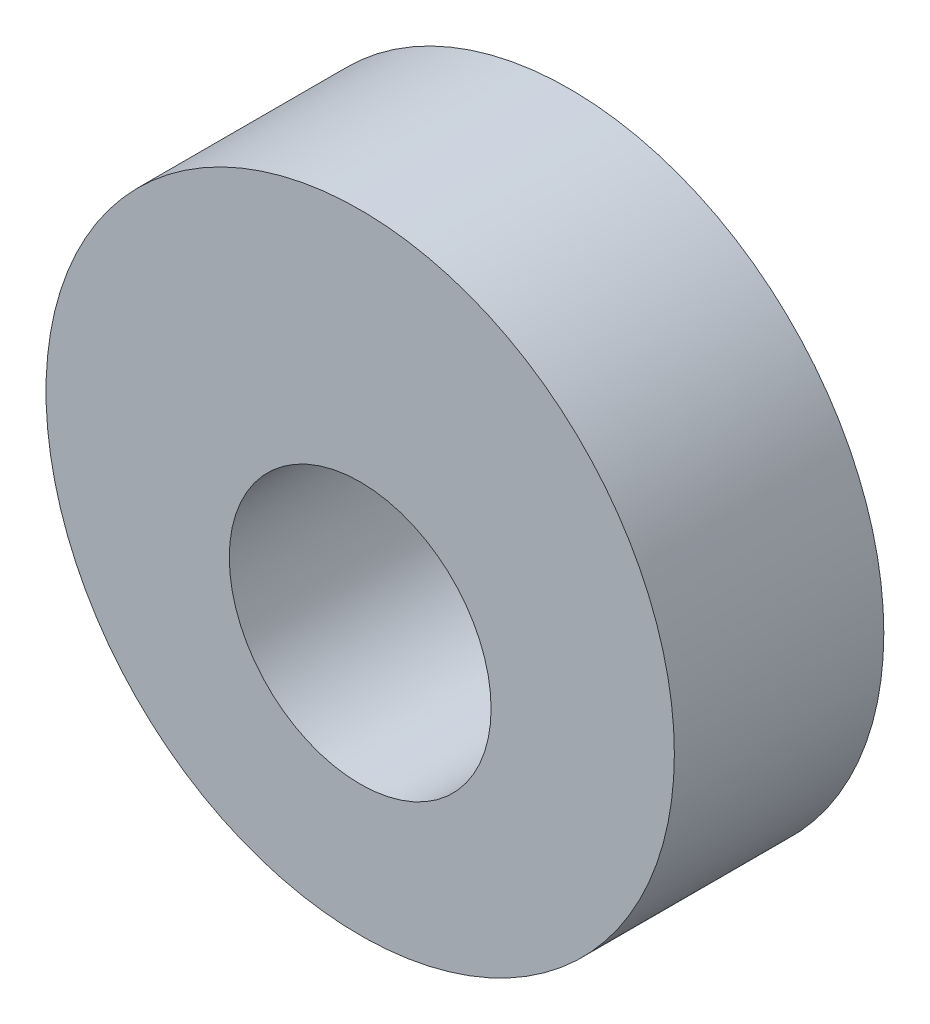
ISO-10303-21;
HEADER;
FILE_DESCRIPTION(('STEP AP214'),'2;1');
FILE_NAME('part.step','',(''),(''),'','','');
FILE_SCHEMA(('AUTOMOTIVE_DESIGN { 1 0 10303 214 1 1 1 1 }'));
ENDSEC;
DATA;
#1=APPLICATION_CONTEXT('core data for automotive mechanical design processes');
#2=APPLICATION_PROTOCOL_DEFINITION('international standard','automotive_design',2000,#1);
#3=PRODUCT_CONTEXT('',#1,'mechanical');
#4=PRODUCT('Part','Part','',(#3));
#5=PRODUCT_RELATED_PRODUCT_CATEGORY('part','',(#4));
#6=PRODUCT_DEFINITION_FORMATION('','',#4);
#7=PRODUCT_DEFINITION_CONTEXT('part definition',#1,'design');
#8=PRODUCT_DEFINITION('design','',#6,#7);
#9=PRODUCT_DEFINITION_SHAPE('','',#8);
#10=(LENGTH_UNIT() NAMED_UNIT(*) SI_UNIT(.MILLI.,.METRE.));
#11=(NAMED_UNIT(*) PLANE_ANGLE_UNIT() SI_UNIT($,.RADIAN.));
#12=(NAMED_UNIT(*) SI_UNIT($,.STERADIAN.) SOLID_ANGLE_UNIT());
#13=UNCERTAINTY_MEASURE_WITH_UNIT(LENGTH_MEASURE(1.E-05),#10,'distance_accuracy_value','');
#14=(GEOMETRIC_REPRESENTATION_CONTEXT(3) GLOBAL_UNCERTAINTY_ASSIGNED_CONTEXT((#13)) GLOBAL_UNIT_ASSIGNED_CONTEXT((#10,
#11,#12)) REPRESENTATION_CONTEXT('',''));
#15=CARTESIAN_POINT('',(0.,0.,0.));
#16=DIRECTION('',(0.,0.,1.));
#17=DIRECTION('',(1.,0.,0.));
#18=AXIS2_PLACEMENT_3D('',#15,#16,#17);
#19=CARTESIAN_POINT('',(0.,-1.5875,3.175));
#20=DIRECTION('',(0.,0.,1.));
#21=DIRECTION('',(1.,0.,0.));
#22=AXIS2_PLACEMENT_3D('',#19,#20,#21);
#23=CYLINDRICAL_SURFACE('',#22,3.96875);
#24=CARTESIAN_POINT('',(0.,-1.5875,3.175));
#25=DIRECTION('',(0.,0.,1.));
#26=DIRECTION('',(1.,0.,0.));
#27=AXIS2_PLACEMENT_3D('',#24,#25,#26);
#28=CIRCLE('',#27,3.96875);
#29=CARTESIAN_POINT('',(3.96875,-1.5875,3.175));
#30=VERTEX_POINT('',#29);
#31=EDGE_CURVE('E40',#30,#30,#28,.T.);
#32=ORIENTED_EDGE('',*,*,#31,.T.);
#33=EDGE_LOOP('',(#32));
#34=FACE_BOUND('',#33,.T.);
#35=CARTESIAN_POINT('',(0.,-1.5875,-3.175));
#36=DIRECTION('',(0.,0.,1.));
#37=DIRECTION('',(1.,0.,0.));
#38=AXIS2_PLACEMENT_3D('',#35,#36,#37);
#39=CIRCLE('',#38,3.96875);
#40=CARTESIAN_POINT('',(3.96875,-1.5875,-3.175));
#41=VERTEX_POINT('',#40);
#42=EDGE_CURVE('E46',#41,#41,#39,.T.);
#43=ORIENTED_EDGE('',*,*,#42,.F.);
#44=EDGE_LOOP('',(#43));
#45=FACE_BOUND('',#44,.T.);
#46=ADVANCED_FACE('F32',(#34,#45),#23,.F.);
#47=CARTESIAN_POINT('',(0.,0.,3.175));
#48=DIRECTION('',(0.,0.,1.));
#49=DIRECTION('',(1.,0.,0.));
#50=AXIS2_PLACEMENT_3D('',#47,#48,#49);
#51=CYLINDRICAL_SURFACE('',#50,9.525);
#52=CARTESIAN_POINT('',(0.,0.,3.175));
#53=DIRECTION('',(0.,0.,1.));
#54=DIRECTION('',(1.,0.,0.));
#55=AXIS2_PLACEMENT_3D('',#52,#53,#54);
#56=CIRCLE('',#55,9.525);
#57=CARTESIAN_POINT('',(9.525,0.,3.175));
#58=VERTEX_POINT('',#57);
#59=EDGE_CURVE('E10',#58,#58,#56,.T.);
#60=ORIENTED_EDGE('',*,*,#59,.F.);
#61=EDGE_LOOP('',(#60));
#62=FACE_BOUND('',#61,.T.);
#63=CARTESIAN_POINT('',(0.,0.,-3.175));
#64=DIRECTION('',(0.,0.,1.));
#65=DIRECTION('',(1.,0.,0.));
#66=AXIS2_PLACEMENT_3D('',#63,#64,#65);
#67=CIRCLE('',#66,9.525);
#68=CARTESIAN_POINT('',(9.525,0.,-3.175));
#69=VERTEX_POINT('',#68);
#70=EDGE_CURVE('E36',#69,#69,#67,.T.);
#71=ORIENTED_EDGE('',*,*,#70,.T.);
#72=EDGE_LOOP('',(#71));
#73=FACE_BOUND('',#72,.T.);
#74=ADVANCED_FACE('F34',(#62,#73),#51,.T.);
#75=CARTESIAN_POINT('',(0.,0.,3.175));
#76=DIRECTION('',(0.,0.,1.));
#77=DIRECTION('',(1.,0.,0.));
#78=AXIS2_PLACEMENT_3D('',#75,#76,#77);
#79=PLANE('',#78);
#80=ORIENTED_EDGE('',*,*,#31,.F.);
#81=EDGE_LOOP('',(#80));
#82=FACE_BOUND('',#81,.T.);
#83=ORIENTED_EDGE('',*,*,#59,.T.);
#84=EDGE_LOOP('',(#83));
#85=FACE_BOUND('',#84,.T.);
#86=ADVANCED_FACE('F56',(#82,#85),#79,.T.);
#87=CARTESIAN_POINT('',(0.,0.,-3.175));
#88=DIRECTION('',(0.,0.,1.));
#89=DIRECTION('',(1.,0.,0.));
#90=AXIS2_PLACEMENT_3D('',#87,#88,#89);
#91=PLANE('',#90);
#92=ORIENTED_EDGE('',*,*,#42,.T.);
#93=EDGE_LOOP('',(#92));
#94=FACE_BOUND('',#93,.T.);
#95=ORIENTED_EDGE('',*,*,#70,.F.);
#96=EDGE_LOOP('',(#95));
#97=FACE_BOUND('',#96,.T.);
#98=ADVANCED_FACE('F54',(#94,#97),#91,.F.);
#99=CLOSED_SHELL('',(#46,#74,#86,#98));
#100=MANIFOLD_SOLID_BREP('B2',#99);
#101=ADVANCED_BREP_SHAPE_REPRESENTATION('',(#18,#100),#14);
#102=SHAPE_DEFINITION_REPRESENTATION(#9,#101);
ENDSEC;
END-ISO-10303-21;
